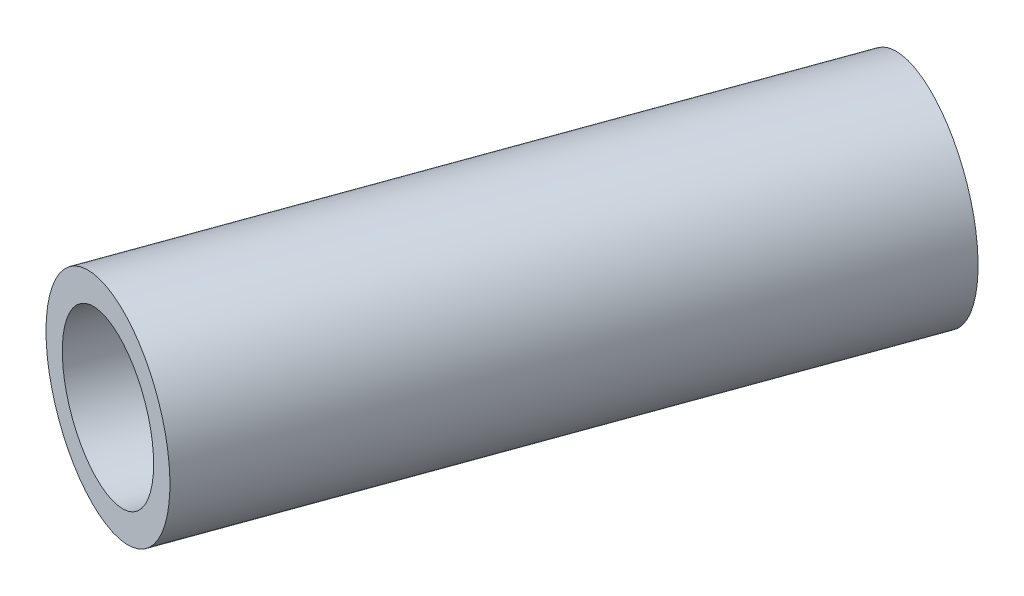
ISO-10303-21;
HEADER;
FILE_DESCRIPTION(('STEP AP214'),'2;1');
FILE_NAME('part.step','',(''),(''),'','','');
FILE_SCHEMA(('AUTOMOTIVE_DESIGN { 1 0 10303 214 1 1 1 1 }'));
ENDSEC;
DATA;
#1=APPLICATION_CONTEXT('core data for automotive mechanical design processes');
#2=APPLICATION_PROTOCOL_DEFINITION('international standard','automotive_design',2000,#1);
#3=PRODUCT_CONTEXT('',#1,'mechanical');
#4=PRODUCT('Part','Part','',(#3));
#5=PRODUCT_RELATED_PRODUCT_CATEGORY('part','',(#4));
#6=PRODUCT_DEFINITION_FORMATION('','',#4);
#7=PRODUCT_DEFINITION_CONTEXT('part definition',#1,'design');
#8=PRODUCT_DEFINITION('design','',#6,#7);
#9=PRODUCT_DEFINITION_SHAPE('','',#8);
#10=(LENGTH_UNIT() NAMED_UNIT(*) SI_UNIT(.MILLI.,.METRE.));
#11=(NAMED_UNIT(*) PLANE_ANGLE_UNIT() SI_UNIT($,.RADIAN.));
#12=(NAMED_UNIT(*) SI_UNIT($,.STERADIAN.) SOLID_ANGLE_UNIT());
#13=UNCERTAINTY_MEASURE_WITH_UNIT(LENGTH_MEASURE(1.E-05),#10,'distance_accuracy_value','');
#14=(GEOMETRIC_REPRESENTATION_CONTEXT(3) GLOBAL_UNCERTAINTY_ASSIGNED_CONTEXT((#13)) GLOBAL_UNIT_ASSIGNED_CONTEXT((#10,
#11,#12)) REPRESENTATION_CONTEXT('',''));
#15=CARTESIAN_POINT('',(0.,0.,0.));
#16=DIRECTION('',(0.,0.,1.));
#17=DIRECTION('',(1.,0.,0.));
#18=AXIS2_PLACEMENT_3D('',#15,#16,#17);
#19=CARTESIAN_POINT('',(198.104724763325,84.5708124907643,-229.252403272386));
#20=DIRECTION('',(0.340654989152248,0.000648546411340683,-0.940188150187628));
#21=DIRECTION('',(-0.940157744768088,0.00830679038207239,-0.340638242401129));
#22=AXIS2_PLACEMENT_3D('',#19,#20,#21);
#23=PLANE('',#22);
#24=CARTESIAN_POINT('',(198.104724763325,84.5708124907643,-229.252403272386));
#25=DIRECTION('',(-0.340654989152249,-0.000648546411340676,0.940188150187628));
#26=DIRECTION('',(0.940157744768088,-0.00830679038207092,0.34063824240113));
#27=AXIS2_PLACEMENT_3D('',#24,#25,#26);
#28=CIRCLE('',#27,3.5);
#29=CARTESIAN_POINT('',(201.395276870013,84.541738724427,-228.060169423983));
#30=VERTEX_POINT('',#29);
#31=EDGE_CURVE('E34',#30,#30,#28,.T.);
#32=ORIENTED_EDGE('',*,*,#31,.F.);
#33=EDGE_LOOP('',(#32));
#34=FACE_BOUND('',#33,.T.);
#35=CARTESIAN_POINT('',(198.104724763325,84.5708124907643,-229.252403272386));
#36=DIRECTION('',(-0.340654989152248,-0.000648546411340683,0.940188150187628));
#37=DIRECTION('',(-0.940157744768088,0.00830679038207152,-0.340638242401129));
#38=AXIS2_PLACEMENT_3D('',#35,#36,#37);
#39=CIRCLE('',#38,4.75);
#40=CARTESIAN_POINT('',(193.638975475677,84.6102697450791,-230.870434923792));
#41=VERTEX_POINT('',#40);
#42=EDGE_CURVE('E11',#41,#41,#39,.T.);
#43=ORIENTED_EDGE('',*,*,#42,.T.);
#44=EDGE_LOOP('',(#43));
#45=FACE_BOUND('',#44,.T.);
#46=ADVANCED_FACE('F17',(#34,#45),#23,.F.);
#47=CARTESIAN_POINT('',(207.98371944874,84.5896203366932,-256.517859627828));
#48=DIRECTION('',(0.340654989152248,0.000648546411340683,-0.940188150187628));
#49=DIRECTION('',(-0.940157744768088,0.00830679038207239,-0.340638242401129));
#50=AXIS2_PLACEMENT_3D('',#47,#48,#49);
#51=PLANE('',#50);
#52=CARTESIAN_POINT('',(207.98371944874,84.5896203366932,-256.517859627828));
#53=DIRECTION('',(-0.340654989152249,-0.000648546411340676,0.940188150187628));
#54=DIRECTION('',(0.940157744768088,-0.00830679038207092,0.34063824240113));
#55=AXIS2_PLACEMENT_3D('',#52,#53,#54);
#56=CIRCLE('',#55,3.5);
#57=CARTESIAN_POINT('',(211.274271555428,84.560546570356,-255.325625779424));
#58=VERTEX_POINT('',#57);
#59=EDGE_CURVE('E27',#58,#58,#56,.T.);
#60=ORIENTED_EDGE('',*,*,#59,.T.);
#61=EDGE_LOOP('',(#60));
#62=FACE_BOUND('',#61,.T.);
#63=CARTESIAN_POINT('',(207.98371944874,84.5896203366932,-256.517859627828));
#64=DIRECTION('',(-0.340654989152248,-0.000648546411340683,0.940188150187628));
#65=DIRECTION('',(-0.940157744768088,0.00830679038207153,-0.340638242401129));
#66=AXIS2_PLACEMENT_3D('',#63,#64,#65);
#67=CIRCLE('',#66,4.75);
#68=CARTESIAN_POINT('',(203.517970161092,84.629077591008,-258.135891279233));
#69=VERTEX_POINT('',#68);
#70=EDGE_CURVE('E21',#69,#69,#67,.T.);
#71=ORIENTED_EDGE('',*,*,#70,.F.);
#72=EDGE_LOOP('',(#71));
#73=FACE_BOUND('',#72,.T.);
#74=ADVANCED_FACE('F44',(#62,#73),#51,.T.);
#75=CARTESIAN_POINT('',(198.104724763325,84.5708124907643,-229.252403272386));
#76=DIRECTION('',(0.340654989152249,0.000648546411340676,-0.940188150187628));
#77=DIRECTION('',(-0.940157744768088,0.00830679038207092,-0.34063824240113));
#78=AXIS2_PLACEMENT_3D('',#75,#76,#77);
#79=CYLINDRICAL_SURFACE('',#78,3.5);
#80=ORIENTED_EDGE('',*,*,#31,.T.);
#81=EDGE_LOOP('',(#80));
#82=FACE_BOUND('',#81,.T.);
#83=ORIENTED_EDGE('',*,*,#59,.F.);
#84=EDGE_LOOP('',(#83));
#85=FACE_BOUND('',#84,.T.);
#86=ADVANCED_FACE('F50',(#82,#85),#79,.F.);
#87=CARTESIAN_POINT('',(198.104724763325,84.5708124907643,-229.252403272386));
#88=DIRECTION('',(0.340654989152249,0.000648546411340676,-0.940188150187628));
#89=DIRECTION('',(-0.940157744768088,0.00830679038207151,-0.34063824240113));
#90=AXIS2_PLACEMENT_3D('',#87,#88,#89);
#91=CYLINDRICAL_SURFACE('',#90,4.75);
#92=ORIENTED_EDGE('',*,*,#42,.F.);
#93=EDGE_LOOP('',(#92));
#94=FACE_BOUND('',#93,.T.);
#95=ORIENTED_EDGE('',*,*,#70,.T.);
#96=EDGE_LOOP('',(#95));
#97=FACE_BOUND('',#96,.T.);
#98=ADVANCED_FACE('F19',(#94,#97),#91,.T.);
#99=CLOSED_SHELL('',(#46,#74,#86,#98));
#100=MANIFOLD_SOLID_BREP('B1',#99);
#101=ADVANCED_BREP_SHAPE_REPRESENTATION('',(#18,#100),#14);
#102=SHAPE_DEFINITION_REPRESENTATION(#9,#101);
ENDSEC;
END-ISO-10303-21;
